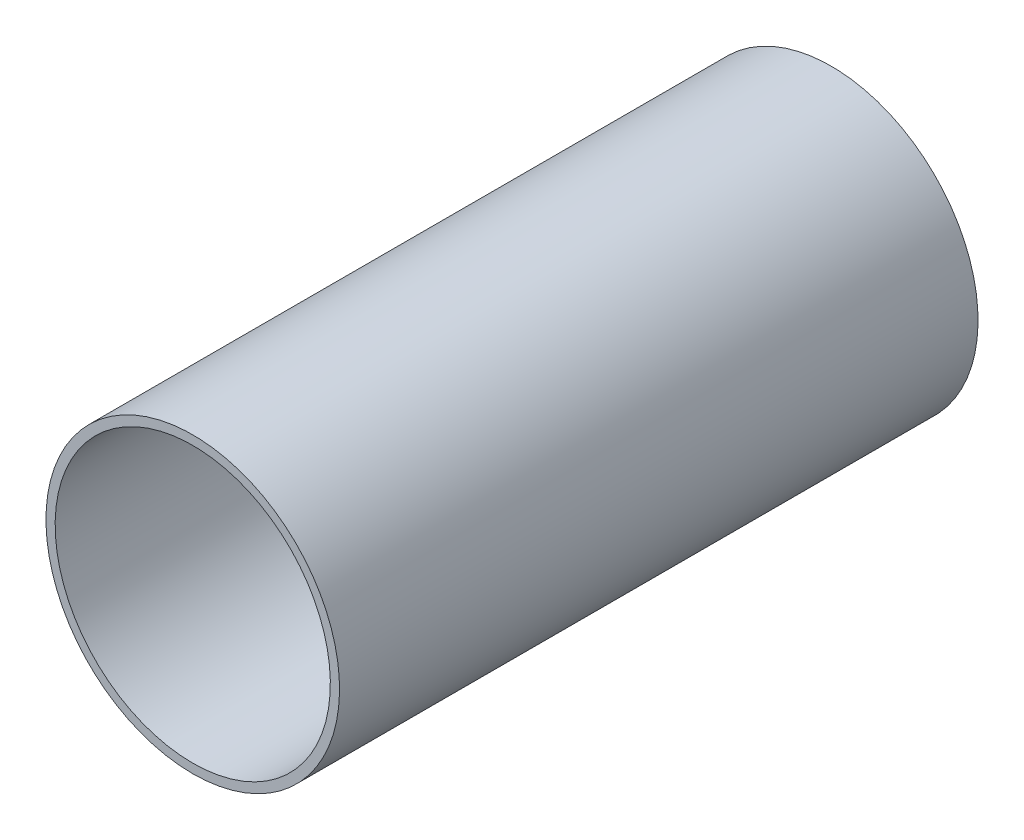
ISO-10303-21;
HEADER;
FILE_DESCRIPTION(('STEP AP214'),'2;1');
FILE_NAME('part.step','',(''),(''),'','','');
FILE_SCHEMA(('AUTOMOTIVE_DESIGN { 1 0 10303 214 1 1 1 1 }'));
ENDSEC;
DATA;
#1=APPLICATION_CONTEXT('core data for automotive mechanical design processes');
#2=APPLICATION_PROTOCOL_DEFINITION('international standard','automotive_design',2000,#1);
#3=PRODUCT_CONTEXT('',#1,'mechanical');
#4=PRODUCT('Part','Part','',(#3));
#5=PRODUCT_RELATED_PRODUCT_CATEGORY('part','',(#4));
#6=PRODUCT_DEFINITION_FORMATION('','',#4);
#7=PRODUCT_DEFINITION_CONTEXT('part definition',#1,'design');
#8=PRODUCT_DEFINITION('design','',#6,#7);
#9=PRODUCT_DEFINITION_SHAPE('','',#8);
#10=(LENGTH_UNIT() NAMED_UNIT(*) SI_UNIT(.MILLI.,.METRE.));
#11=(NAMED_UNIT(*) PLANE_ANGLE_UNIT() SI_UNIT($,.RADIAN.));
#12=(NAMED_UNIT(*) SI_UNIT($,.STERADIAN.) SOLID_ANGLE_UNIT());
#13=UNCERTAINTY_MEASURE_WITH_UNIT(LENGTH_MEASURE(1.E-05),#10,'distance_accuracy_value','');
#14=(GEOMETRIC_REPRESENTATION_CONTEXT(3) GLOBAL_UNCERTAINTY_ASSIGNED_CONTEXT((#13)) GLOBAL_UNIT_ASSIGNED_CONTEXT((#10,
#11,#12)) REPRESENTATION_CONTEXT('',''));
#15=CARTESIAN_POINT('',(0.,0.,0.));
#16=DIRECTION('',(0.,0.,1.));
#17=DIRECTION('',(1.,0.,0.));
#18=AXIS2_PLACEMENT_3D('',#15,#16,#17);
#19=CARTESIAN_POINT('',(137.16,-103.632,-0.045));
#20=DIRECTION('',(0.,0.,-1.));
#21=DIRECTION('',(0.,-1.,0.));
#22=AXIS2_PLACEMENT_3D('',#19,#20,#21);
#23=CYLINDRICAL_SURFACE('',#22,0.375);
#24=CARTESIAN_POINT('',(137.16,-103.632,-0.035));
#25=DIRECTION('',(0.,0.,-1.));
#26=DIRECTION('',(0.,-1.,0.));
#27=AXIS2_PLACEMENT_3D('',#24,#25,#26);
#28=CIRCLE('',#27,0.375);
#29=CARTESIAN_POINT('',(137.16,-104.007,-0.035));
#30=VERTEX_POINT('',#29);
#31=EDGE_CURVE('E64',#30,#30,#28,.T.);
#32=ORIENTED_EDGE('',*,*,#31,.T.);
#33=DIRECTION('',(0.,0.,1.));
#34=VECTOR('',#33,1.);
#35=CARTESIAN_POINT('',(137.16,-104.007,-0.045));
#36=LINE('',#35,#34);
#37=CARTESIAN_POINT('',(137.16,-104.007,1.705));
#38=VERTEX_POINT('',#37);
#39=EDGE_CURVE('E11',#30,#38,#36,.T.);
#40=ORIENTED_EDGE('',*,*,#39,.T.);
#41=CARTESIAN_POINT('',(137.16,-103.632,1.705));
#42=DIRECTION('',(0.,0.,-1.));
#43=DIRECTION('',(0.,-1.,0.));
#44=AXIS2_PLACEMENT_3D('',#41,#42,#43);
#45=CIRCLE('',#44,0.375);
#46=EDGE_CURVE('E25',#38,#38,#45,.T.);
#47=ORIENTED_EDGE('',*,*,#46,.F.);
#48=ORIENTED_EDGE('',*,*,#39,.F.);
#49=EDGE_LOOP('',(#32,#40,#47,#48));
#50=FACE_BOUND('',#49,.T.);
#51=ADVANCED_FACE('F17',(#50),#23,.F.);
#52=CARTESIAN_POINT('',(137.16,-104.032,1.705));
#53=DIRECTION('',(0.,0.,1.));
#54=DIRECTION('',(1.,0.,0.));
#55=AXIS2_PLACEMENT_3D('',#52,#53,#54);
#56=PLANE('',#55);
#57=ORIENTED_EDGE('',*,*,#46,.T.);
#58=EDGE_LOOP('',(#57));
#59=FACE_BOUND('',#58,.T.);
#60=CARTESIAN_POINT('',(137.16,-103.632,1.705));
#61=DIRECTION('',(0.,0.,1.));
#62=DIRECTION('',(0.,-1.,0.));
#63=AXIS2_PLACEMENT_3D('',#60,#61,#62);
#64=CIRCLE('',#63,0.4);
#65=CARTESIAN_POINT('',(137.16,-104.032,1.705));
#66=VERTEX_POINT('',#65);
#67=EDGE_CURVE('E56',#66,#66,#64,.T.);
#68=ORIENTED_EDGE('',*,*,#67,.T.);
#69=EDGE_LOOP('',(#68));
#70=FACE_BOUND('',#69,.T.);
#71=ADVANCED_FACE('F73',(#59,#70),#56,.T.);
#72=CARTESIAN_POINT('',(137.16,-104.032,-0.035));
#73=DIRECTION('',(0.,0.,1.));
#74=DIRECTION('',(1.,0.,0.));
#75=AXIS2_PLACEMENT_3D('',#72,#73,#74);
#76=PLANE('',#75);
#77=ORIENTED_EDGE('',*,*,#31,.F.);
#78=EDGE_LOOP('',(#77));
#79=FACE_BOUND('',#78,.T.);
#80=CARTESIAN_POINT('',(137.16,-103.632,-0.035));
#81=DIRECTION('',(0.,0.,1.));
#82=DIRECTION('',(0.,-1.,0.));
#83=AXIS2_PLACEMENT_3D('',#80,#81,#82);
#84=CIRCLE('',#83,0.4);
#85=CARTESIAN_POINT('',(137.16,-104.032,-0.035));
#86=VERTEX_POINT('',#85);
#87=EDGE_CURVE('E55',#86,#86,#84,.T.);
#88=ORIENTED_EDGE('',*,*,#87,.F.);
#89=EDGE_LOOP('',(#88));
#90=FACE_BOUND('',#89,.T.);
#91=ADVANCED_FACE('F82',(#79,#90),#76,.F.);
#92=CARTESIAN_POINT('',(137.16,-103.632,-0.035));
#93=DIRECTION('',(0.,0.,-1.));
#94=DIRECTION('',(0.,-1.,0.));
#95=AXIS2_PLACEMENT_3D('',#92,#93,#94);
#96=CYLINDRICAL_SURFACE('',#95,0.4);
#97=ORIENTED_EDGE('',*,*,#87,.T.);
#98=DIRECTION('',(0.,0.,1.));
#99=VECTOR('',#98,1.);
#100=CARTESIAN_POINT('',(137.16,-104.032,-0.035));
#101=LINE('',#100,#99);
#102=EDGE_CURVE('E52',#86,#66,#101,.T.);
#103=ORIENTED_EDGE('',*,*,#102,.T.);
#104=ORIENTED_EDGE('',*,*,#67,.F.);
#105=ORIENTED_EDGE('',*,*,#102,.F.);
#106=EDGE_LOOP('',(#97,#103,#104,#105));
#107=FACE_BOUND('',#106,.T.);
#108=ADVANCED_FACE('F53',(#107),#96,.T.);
#109=CLOSED_SHELL('',(#51,#71,#91,#108));
#110=MANIFOLD_SOLID_BREP('B1',#109);
#111=ADVANCED_BREP_SHAPE_REPRESENTATION('',(#18,#110),#14);
#112=SHAPE_DEFINITION_REPRESENTATION(#9,#111);
ENDSEC;
END-ISO-10303-21;
